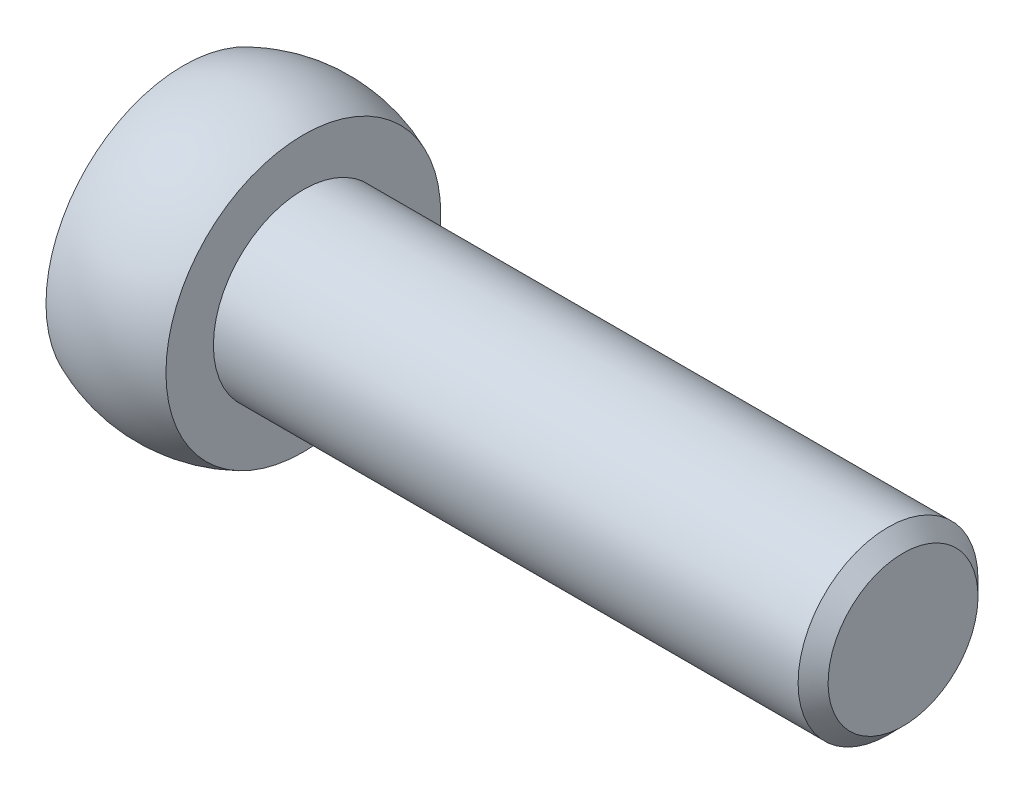
ISO-10303-21;
HEADER;
FILE_DESCRIPTION(('STEP AP214'),'2;1');
FILE_NAME('part.step','',(''),(''),'','','');
FILE_SCHEMA(('AUTOMOTIVE_DESIGN { 1 0 10303 214 1 1 1 1 }'));
ENDSEC;
DATA;
#1=APPLICATION_CONTEXT('core data for automotive mechanical design processes');
#2=APPLICATION_PROTOCOL_DEFINITION('international standard','automotive_design',2000,#1);
#3=PRODUCT_CONTEXT('',#1,'mechanical');
#4=PRODUCT('Part','Part','',(#3));
#5=PRODUCT_RELATED_PRODUCT_CATEGORY('part','',(#4));
#6=PRODUCT_DEFINITION_FORMATION('','',#4);
#7=PRODUCT_DEFINITION_CONTEXT('part definition',#1,'design');
#8=PRODUCT_DEFINITION('design','',#6,#7);
#9=PRODUCT_DEFINITION_SHAPE('','',#8);
#10=(LENGTH_UNIT() NAMED_UNIT(*) SI_UNIT(.MILLI.,.METRE.));
#11=(NAMED_UNIT(*) PLANE_ANGLE_UNIT() SI_UNIT($,.RADIAN.));
#12=(NAMED_UNIT(*) SI_UNIT($,.STERADIAN.) SOLID_ANGLE_UNIT());
#13=UNCERTAINTY_MEASURE_WITH_UNIT(LENGTH_MEASURE(1.E-05),#10,'distance_accuracy_value','');
#14=(GEOMETRIC_REPRESENTATION_CONTEXT(3) GLOBAL_UNCERTAINTY_ASSIGNED_CONTEXT((#13)) GLOBAL_UNIT_ASSIGNED_CONTEXT((#10,
#11,#12)) REPRESENTATION_CONTEXT('',''));
#15=CARTESIAN_POINT('',(0.,0.,0.));
#16=DIRECTION('',(0.,0.,1.));
#17=DIRECTION('',(1.,0.,0.));
#18=AXIS2_PLACEMENT_3D('',#15,#16,#17);
#19=CARTESIAN_POINT('',(0.,0.,0.));
#20=DIRECTION('',(-1.,0.,0.));
#21=DIRECTION('',(0.,-1.,0.));
#22=AXIS2_PLACEMENT_3D('',#19,#20,#21);
#23=PLANE('',#22);
#24=CARTESIAN_POINT('',(0.,0.,0.));
#25=DIRECTION('',(1.,0.,0.));
#26=DIRECTION('',(0.,1.,0.));
#27=AXIS2_PLACEMENT_3D('',#24,#25,#26);
#28=CIRCLE('',#27,4.58257569495584);
#29=CARTESIAN_POINT('',(0.,4.58257569495584,0.));
#30=VERTEX_POINT('',#29);
#31=EDGE_CURVE('E10',#30,#30,#28,.T.);
#32=ORIENTED_EDGE('',*,*,#31,.F.);
#33=EDGE_LOOP('',(#32));
#34=FACE_BOUND('',#33,.T.);
#35=ADVANCED_FACE('F29',(#34),#23,.T.);
#36=CARTESIAN_POINT('',(2.,0.,0.));
#37=DIRECTION('',(1.,0.,0.));
#38=DIRECTION('',(0.,1.,0.));
#39=AXIS2_PLACEMENT_3D('',#36,#37,#38);
#40=SPHERICAL_SURFACE('',#39,5.);
#41=ORIENTED_EDGE('',*,*,#31,.T.);
#42=EDGE_LOOP('',(#41));
#43=FACE_BOUND('',#42,.T.);
#44=CARTESIAN_POINT('',(4.,0.,0.));
#45=DIRECTION('',(1.,0.,0.));
#46=DIRECTION('',(0.,1.,0.));
#47=AXIS2_PLACEMENT_3D('',#44,#45,#46);
#48=CIRCLE('',#47,4.58257569495584);
#49=CARTESIAN_POINT('',(4.,4.58257569495584,0.));
#50=VERTEX_POINT('',#49);
#51=EDGE_CURVE('E35',#50,#50,#48,.T.);
#52=ORIENTED_EDGE('',*,*,#51,.F.);
#53=EDGE_LOOP('',(#52));
#54=FACE_BOUND('',#53,.T.);
#55=ADVANCED_FACE('F68',(#43,#54),#40,.T.);
#56=CARTESIAN_POINT('',(4.,4.58257569495584,0.));
#57=DIRECTION('',(1.,0.,0.));
#58=DIRECTION('',(0.,1.,0.));
#59=AXIS2_PLACEMENT_3D('',#56,#57,#58);
#60=PLANE('',#59);
#61=ORIENTED_EDGE('',*,*,#51,.T.);
#62=EDGE_LOOP('',(#61));
#63=FACE_BOUND('',#62,.T.);
#64=CARTESIAN_POINT('',(4.,0.,0.));
#65=DIRECTION('',(1.,0.,0.));
#66=DIRECTION('',(0.,1.,0.));
#67=AXIS2_PLACEMENT_3D('',#64,#65,#66);
#68=CIRCLE('',#67,3.);
#69=CARTESIAN_POINT('',(4.,3.,0.));
#70=VERTEX_POINT('',#69);
#71=EDGE_CURVE('E39',#70,#70,#68,.T.);
#72=ORIENTED_EDGE('',*,*,#71,.F.);
#73=EDGE_LOOP('',(#72));
#74=FACE_BOUND('',#73,.T.);
#75=ADVANCED_FACE('F64',(#63,#74),#60,.T.);
#76=CARTESIAN_POINT('',(0.,0.,0.));
#77=DIRECTION('',(1.,0.,0.));
#78=DIRECTION('',(0.,1.,0.));
#79=AXIS2_PLACEMENT_3D('',#76,#77,#78);
#80=CYLINDRICAL_SURFACE('',#79,3.);
#81=ORIENTED_EDGE('',*,*,#71,.T.);
#82=EDGE_LOOP('',(#81));
#83=FACE_BOUND('',#82,.T.);
#84=CARTESIAN_POINT('',(23.5,0.,0.));
#85=DIRECTION('',(1.,0.,0.));
#86=DIRECTION('',(0.,1.,0.));
#87=AXIS2_PLACEMENT_3D('',#84,#85,#86);
#88=CIRCLE('',#87,3.);
#89=CARTESIAN_POINT('',(23.5,3.,0.));
#90=VERTEX_POINT('',#89);
#91=EDGE_CURVE('E43',#90,#90,#88,.T.);
#92=ORIENTED_EDGE('',*,*,#91,.F.);
#93=EDGE_LOOP('',(#92));
#94=FACE_BOUND('',#93,.T.);
#95=ADVANCED_FACE('F56',(#83,#94),#80,.T.);
#96=CARTESIAN_POINT('',(24.,0.,0.));
#97=DIRECTION('',(-1.,0.,0.));
#98=DIRECTION('',(0.,-1.,0.));
#99=AXIS2_PLACEMENT_3D('',#96,#97,#98);
#100=CONICAL_SURFACE('',#99,2.5,0.785398163397446);
#101=ORIENTED_EDGE('',*,*,#91,.T.);
#102=EDGE_LOOP('',(#101));
#103=FACE_BOUND('',#102,.T.);
#104=CARTESIAN_POINT('',(24.,0.,0.));
#105=DIRECTION('',(1.,0.,0.));
#106=DIRECTION('',(0.,1.,0.));
#107=AXIS2_PLACEMENT_3D('',#104,#105,#106);
#108=CIRCLE('',#107,2.5);
#109=CARTESIAN_POINT('',(24.,2.5,0.));
#110=VERTEX_POINT('',#109);
#111=EDGE_CURVE('E48',#110,#110,#108,.T.);
#112=ORIENTED_EDGE('',*,*,#111,.F.);
#113=EDGE_LOOP('',(#112));
#114=FACE_BOUND('',#113,.T.);
#115=ADVANCED_FACE('F54',(#103,#114),#100,.T.);
#116=CARTESIAN_POINT('',(24.,2.5,0.));
#117=DIRECTION('',(1.,0.,0.));
#118=DIRECTION('',(0.,1.,0.));
#119=AXIS2_PLACEMENT_3D('',#116,#117,#118);
#120=PLANE('',#119);
#121=ORIENTED_EDGE('',*,*,#111,.T.);
#122=EDGE_LOOP('',(#121));
#123=FACE_BOUND('',#122,.T.);
#124=ADVANCED_FACE('F52',(#123),#120,.T.);
#125=CLOSED_SHELL('',(#35,#55,#75,#95,#115,#124));
#126=MANIFOLD_SOLID_BREP('B2',#125);
#127=ADVANCED_BREP_SHAPE_REPRESENTATION('',(#18,#126),#14);
#128=SHAPE_DEFINITION_REPRESENTATION(#9,#127);
ENDSEC;
END-ISO-10303-21;
